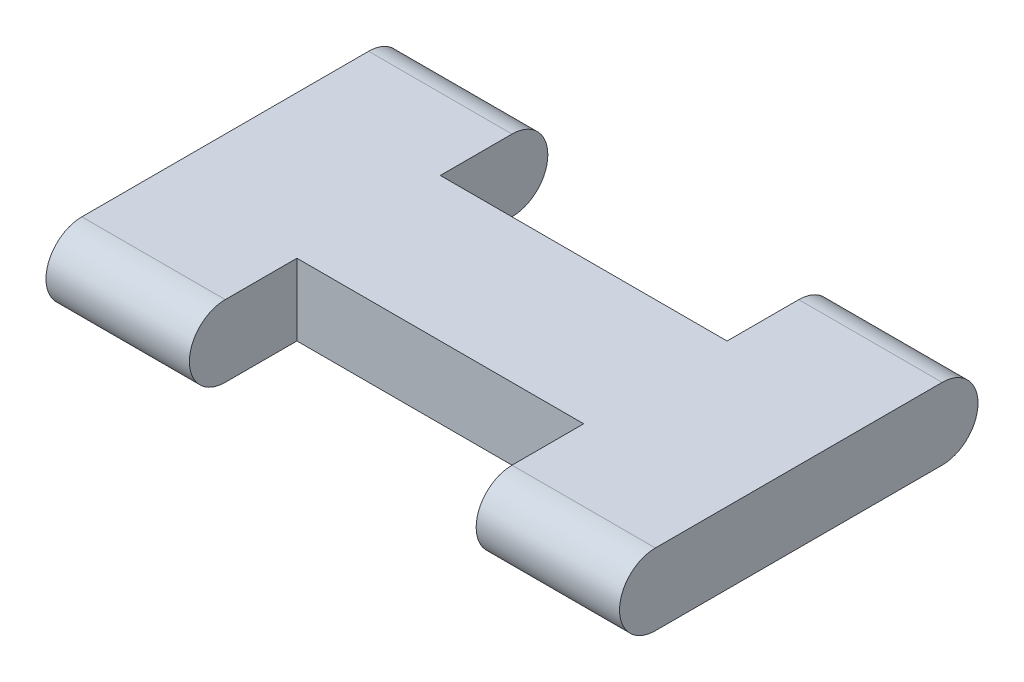
ISO-10303-21;
HEADER;
FILE_DESCRIPTION(('STEP AP214'),'2;1');
FILE_NAME('part.step','',(''),(''),'','','');
FILE_SCHEMA(('AUTOMOTIVE_DESIGN { 1 0 10303 214 1 1 1 1 }'));
ENDSEC;
DATA;
#1=APPLICATION_CONTEXT('core data for automotive mechanical design processes');
#2=APPLICATION_PROTOCOL_DEFINITION('international standard','automotive_design',2000,#1);
#3=PRODUCT_CONTEXT('',#1,'mechanical');
#4=PRODUCT('Part','Part','',(#3));
#5=PRODUCT_RELATED_PRODUCT_CATEGORY('part','',(#4));
#6=PRODUCT_DEFINITION_FORMATION('','',#4);
#7=PRODUCT_DEFINITION_CONTEXT('part definition',#1,'design');
#8=PRODUCT_DEFINITION('design','',#6,#7);
#9=PRODUCT_DEFINITION_SHAPE('','',#8);
#10=(LENGTH_UNIT() NAMED_UNIT(*) SI_UNIT(.MILLI.,.METRE.));
#11=(NAMED_UNIT(*) PLANE_ANGLE_UNIT() SI_UNIT($,.RADIAN.));
#12=(NAMED_UNIT(*) SI_UNIT($,.STERADIAN.) SOLID_ANGLE_UNIT());
#13=UNCERTAINTY_MEASURE_WITH_UNIT(LENGTH_MEASURE(1.E-05),#10,'distance_accuracy_value','');
#14=(GEOMETRIC_REPRESENTATION_CONTEXT(3) GLOBAL_UNCERTAINTY_ASSIGNED_CONTEXT((#13)) GLOBAL_UNIT_ASSIGNED_CONTEXT((#10,
#11,#12)) REPRESENTATION_CONTEXT('',''));
#15=CARTESIAN_POINT('',(0.,0.,0.));
#16=DIRECTION('',(0.,0.,1.));
#17=DIRECTION('',(1.,0.,0.));
#18=AXIS2_PLACEMENT_3D('',#15,#16,#17);
#19=CARTESIAN_POINT('',(16.,0.,4.));
#20=DIRECTION('',(-1.,0.,0.));
#21=DIRECTION('',(0.,0.,1.));
#22=AXIS2_PLACEMENT_3D('',#19,#20,#21);
#23=CYLINDRICAL_SURFACE('',#22,1.);
#24=DIRECTION('',(-1.,0.,0.));
#25=VECTOR('',#24,1.);
#26=CARTESIAN_POINT('',(16.,1.,4.));
#27=LINE('',#26,#25);
#28=CARTESIAN_POINT('',(16.,1.,4.));
#29=VERTEX_POINT('',#28);
#30=CARTESIAN_POINT('',(12.,1.,4.));
#31=VERTEX_POINT('',#30);
#32=EDGE_CURVE('E201',#29,#31,#27,.T.);
#33=ORIENTED_EDGE('',*,*,#32,.T.);
#34=CARTESIAN_POINT('',(12.,0.,4.));
#35=DIRECTION('',(1.,0.,0.));
#36=DIRECTION('',(0.,0.,-1.));
#37=AXIS2_PLACEMENT_3D('',#34,#35,#36);
#38=CIRCLE('',#37,1.);
#39=CARTESIAN_POINT('',(12.,-1.,4.));
#40=VERTEX_POINT('',#39);
#41=EDGE_CURVE('E165',#31,#40,#38,.T.);
#42=ORIENTED_EDGE('',*,*,#41,.T.);
#43=DIRECTION('',(-1.,0.,0.));
#44=VECTOR('',#43,1.);
#45=CARTESIAN_POINT('',(16.,-1.,4.));
#46=LINE('',#45,#44);
#47=CARTESIAN_POINT('',(16.,-1.,4.));
#48=VERTEX_POINT('',#47);
#49=EDGE_CURVE('E211',#48,#40,#46,.T.);
#50=ORIENTED_EDGE('',*,*,#49,.F.);
#51=CARTESIAN_POINT('',(16.,0.,4.));
#52=DIRECTION('',(1.,0.,0.));
#53=DIRECTION('',(0.,0.,-1.));
#54=AXIS2_PLACEMENT_3D('',#51,#52,#53);
#55=CIRCLE('',#54,1.);
#56=EDGE_CURVE('E180',#29,#48,#55,.T.);
#57=ORIENTED_EDGE('',*,*,#56,.F.);
#58=EDGE_LOOP('',(#33,#42,#50,#57));
#59=FACE_BOUND('',#58,.T.);
#60=ADVANCED_FACE('F34',(#59),#23,.T.);
#61=CARTESIAN_POINT('',(16.,0.,-4.));
#62=DIRECTION('',(-1.,0.,0.));
#63=DIRECTION('',(0.,0.,1.));
#64=AXIS2_PLACEMENT_3D('',#61,#62,#63);
#65=CYLINDRICAL_SURFACE('',#64,1.);
#66=DIRECTION('',(-1.,0.,0.));
#67=VECTOR('',#66,1.);
#68=CARTESIAN_POINT('',(16.,1.,-4.));
#69=LINE('',#68,#67);
#70=CARTESIAN_POINT('',(4.,1.,-4.));
#71=VERTEX_POINT('',#70);
#72=CARTESIAN_POINT('',(0.,1.,-4.));
#73=VERTEX_POINT('',#72);
#74=EDGE_CURVE('E204',#71,#73,#69,.T.);
#75=ORIENTED_EDGE('',*,*,#74,.F.);
#76=CARTESIAN_POINT('',(4.,0.,-4.));
#77=DIRECTION('',(-1.,0.,0.));
#78=DIRECTION('',(0.,0.,1.));
#79=AXIS2_PLACEMENT_3D('',#76,#77,#78);
#80=CIRCLE('',#79,1.);
#81=CARTESIAN_POINT('',(4.,-0.999999999999999,-4.));
#82=VERTEX_POINT('',#81);
#83=EDGE_CURVE('E173',#71,#82,#80,.T.);
#84=ORIENTED_EDGE('',*,*,#83,.T.);
#85=DIRECTION('',(-1.,0.,0.));
#86=VECTOR('',#85,1.);
#87=CARTESIAN_POINT('',(16.,-0.999999999999999,-4.));
#88=LINE('',#87,#86);
#89=CARTESIAN_POINT('',(0.,-0.999999999999999,-4.));
#90=VERTEX_POINT('',#89);
#91=EDGE_CURVE('E206',#82,#90,#88,.T.);
#92=ORIENTED_EDGE('',*,*,#91,.T.);
#93=CARTESIAN_POINT('',(0.,0.,-4.));
#94=DIRECTION('',(1.,0.,0.));
#95=DIRECTION('',(0.,0.,-1.));
#96=AXIS2_PLACEMENT_3D('',#93,#94,#95);
#97=CIRCLE('',#96,1.);
#98=EDGE_CURVE('E196',#90,#73,#97,.T.);
#99=ORIENTED_EDGE('',*,*,#98,.T.);
#100=EDGE_LOOP('',(#75,#84,#92,#99));
#101=FACE_BOUND('',#100,.T.);
#102=ADVANCED_FACE('F234',(#101),#65,.T.);
#103=CARTESIAN_POINT('',(4.,-1.,4.));
#104=VERTEX_POINT('',#103);
#105=CARTESIAN_POINT('',(0.,-1.,4.));
#106=VERTEX_POINT('',#105);
#107=EDGE_CURVE('E210',#104,#106,#46,.T.);
#108=ORIENTED_EDGE('',*,*,#107,.F.);
#109=CARTESIAN_POINT('',(4.,0.,4.));
#110=DIRECTION('',(-1.,0.,0.));
#111=DIRECTION('',(0.,0.,1.));
#112=AXIS2_PLACEMENT_3D('',#109,#110,#111);
#113=CIRCLE('',#112,1.);
#114=CARTESIAN_POINT('',(4.,1.,4.));
#115=VERTEX_POINT('',#114);
#116=EDGE_CURVE('E159',#104,#115,#113,.T.);
#117=ORIENTED_EDGE('',*,*,#116,.T.);
#118=CARTESIAN_POINT('',(0.,1.,4.));
#119=VERTEX_POINT('',#118);
#120=EDGE_CURVE('E190',#115,#119,#27,.T.);
#121=ORIENTED_EDGE('',*,*,#120,.T.);
#122=CARTESIAN_POINT('',(0.,0.,4.));
#123=DIRECTION('',(1.,0.,0.));
#124=DIRECTION('',(0.,0.,-1.));
#125=AXIS2_PLACEMENT_3D('',#122,#123,#124);
#126=CIRCLE('',#125,1.);
#127=EDGE_CURVE('E179',#119,#106,#126,.T.);
#128=ORIENTED_EDGE('',*,*,#127,.T.);
#129=EDGE_LOOP('',(#108,#117,#121,#128));
#130=FACE_BOUND('',#129,.T.);
#131=ADVANCED_FACE('F36',(#130),#23,.T.);
#132=CARTESIAN_POINT('',(16.,-1.,4.));
#133=DIRECTION('',(0.,1.,0.));
#134=DIRECTION('',(0.,0.,1.));
#135=AXIS2_PLACEMENT_3D('',#132,#133,#134);
#136=PLANE('',#135);
#137=ORIENTED_EDGE('',*,*,#91,.F.);
#138=DIRECTION('',(0.,0.,1.));
#139=VECTOR('',#138,1.);
#140=CARTESIAN_POINT('',(4.,-1.,4.));
#141=LINE('',#140,#139);
#142=CARTESIAN_POINT('',(4.,-0.999999999999999,-2.));
#143=VERTEX_POINT('',#142);
#144=EDGE_CURVE('E176',#82,#143,#141,.T.);
#145=ORIENTED_EDGE('',*,*,#144,.T.);
#146=DIRECTION('',(1.,0.,0.));
#147=VECTOR('',#146,1.);
#148=CARTESIAN_POINT('',(16.,-0.999999999999999,-2.));
#149=LINE('',#148,#147);
#150=CARTESIAN_POINT('',(12.,-0.999999999999999,-2.));
#151=VERTEX_POINT('',#150);
#152=EDGE_CURVE('E168',#143,#151,#149,.T.);
#153=ORIENTED_EDGE('',*,*,#152,.T.);
#154=DIRECTION('',(0.,0.,-1.));
#155=VECTOR('',#154,1.);
#156=CARTESIAN_POINT('',(12.,-1.,4.));
#157=LINE('',#156,#155);
#158=CARTESIAN_POINT('',(12.,-0.999999999999999,-4.));
#159=VERTEX_POINT('',#158);
#160=EDGE_CURVE('E130',#151,#159,#157,.T.);
#161=ORIENTED_EDGE('',*,*,#160,.T.);
#162=CARTESIAN_POINT('',(16.,-0.999999999999999,-4.));
#163=VERTEX_POINT('',#162);
#164=EDGE_CURVE('E207',#163,#159,#88,.T.);
#165=ORIENTED_EDGE('',*,*,#164,.F.);
#166=DIRECTION('',(0.,0.,-1.));
#167=VECTOR('',#166,1.);
#168=CARTESIAN_POINT('',(16.,-1.,4.));
#169=LINE('',#168,#167);
#170=EDGE_CURVE('E183',#48,#163,#169,.T.);
#171=ORIENTED_EDGE('',*,*,#170,.F.);
#172=ORIENTED_EDGE('',*,*,#49,.T.);
#173=DIRECTION('',(0.,0.,-1.));
#174=VECTOR('',#173,1.);
#175=CARTESIAN_POINT('',(12.,-1.,4.));
#176=LINE('',#175,#174);
#177=CARTESIAN_POINT('',(12.,-0.999999999999999,2.));
#178=VERTEX_POINT('',#177);
#179=EDGE_CURVE('E162',#40,#178,#176,.T.);
#180=ORIENTED_EDGE('',*,*,#179,.T.);
#181=DIRECTION('',(-1.,0.,0.));
#182=VECTOR('',#181,1.);
#183=CARTESIAN_POINT('',(16.,-1.,2.));
#184=LINE('',#183,#182);
#185=CARTESIAN_POINT('',(4.,-0.999999999999999,2.));
#186=VERTEX_POINT('',#185);
#187=EDGE_CURVE('E132',#178,#186,#184,.T.);
#188=ORIENTED_EDGE('',*,*,#187,.T.);
#189=DIRECTION('',(0.,0.,1.));
#190=VECTOR('',#189,1.);
#191=CARTESIAN_POINT('',(4.,-1.,4.));
#192=LINE('',#191,#190);
#193=EDGE_CURVE('E156',#186,#104,#192,.T.);
#194=ORIENTED_EDGE('',*,*,#193,.T.);
#195=ORIENTED_EDGE('',*,*,#107,.T.);
#196=DIRECTION('',(0.,0.,-1.));
#197=VECTOR('',#196,1.);
#198=CARTESIAN_POINT('',(0.,-1.,4.));
#199=LINE('',#198,#197);
#200=EDGE_CURVE('E193',#106,#90,#199,.T.);
#201=ORIENTED_EDGE('',*,*,#200,.T.);
#202=EDGE_LOOP('',(#137,#145,#153,#161,#165,#171,#172,#180,#188,#194,#195,#201));
#203=FACE_BOUND('',#202,.T.);
#204=ADVANCED_FACE('F229',(#203),#136,.F.);
#205=ORIENTED_EDGE('',*,*,#164,.T.);
#206=CARTESIAN_POINT('',(12.,0.,-4.));
#207=DIRECTION('',(1.,0.,0.));
#208=DIRECTION('',(0.,0.,-1.));
#209=AXIS2_PLACEMENT_3D('',#206,#207,#208);
#210=CIRCLE('',#209,1.);
#211=CARTESIAN_POINT('',(12.,1.,-4.));
#212=VERTEX_POINT('',#211);
#213=EDGE_CURVE('E170',#159,#212,#210,.T.);
#214=ORIENTED_EDGE('',*,*,#213,.T.);
#215=CARTESIAN_POINT('',(16.,1.,-4.));
#216=VERTEX_POINT('',#215);
#217=EDGE_CURVE('E144',#216,#212,#69,.T.);
#218=ORIENTED_EDGE('',*,*,#217,.F.);
#219=CARTESIAN_POINT('',(16.,0.,-4.));
#220=DIRECTION('',(1.,0.,0.));
#221=DIRECTION('',(0.,0.,-1.));
#222=AXIS2_PLACEMENT_3D('',#219,#220,#221);
#223=CIRCLE('',#222,1.);
#224=EDGE_CURVE('E186',#163,#216,#223,.T.);
#225=ORIENTED_EDGE('',*,*,#224,.F.);
#226=EDGE_LOOP('',(#205,#214,#218,#225));
#227=FACE_BOUND('',#226,.T.);
#228=ADVANCED_FACE('F226',(#227),#65,.T.);
#229=CARTESIAN_POINT('',(16.,1.,4.));
#230=DIRECTION('',(0.,-1.,0.));
#231=DIRECTION('',(0.,0.,-1.));
#232=AXIS2_PLACEMENT_3D('',#229,#230,#231);
#233=PLANE('',#232);
#234=DIRECTION('',(1.,0.,0.));
#235=VECTOR('',#234,1.);
#236=CARTESIAN_POINT('',(12.,1.,-2.));
#237=LINE('',#236,#235);
#238=CARTESIAN_POINT('',(4.,1.,-2.));
#239=VERTEX_POINT('',#238);
#240=CARTESIAN_POINT('',(12.,1.,-2.));
#241=VERTEX_POINT('',#240);
#242=EDGE_CURVE('E135',#239,#241,#237,.T.);
#243=ORIENTED_EDGE('',*,*,#242,.F.);
#244=DIRECTION('',(0.,0.,-1.));
#245=VECTOR('',#244,1.);
#246=CARTESIAN_POINT('',(4.,1.,4.));
#247=LINE('',#246,#245);
#248=EDGE_CURVE('E11',#239,#71,#247,.T.);
#249=ORIENTED_EDGE('',*,*,#248,.T.);
#250=ORIENTED_EDGE('',*,*,#74,.T.);
#251=DIRECTION('',(0.,0.,1.));
#252=VECTOR('',#251,1.);
#253=CARTESIAN_POINT('',(0.,1.,4.));
#254=LINE('',#253,#252);
#255=EDGE_CURVE('E184',#73,#119,#254,.T.);
#256=ORIENTED_EDGE('',*,*,#255,.T.);
#257=ORIENTED_EDGE('',*,*,#120,.F.);
#258=DIRECTION('',(0.,0.,1.));
#259=VECTOR('',#258,1.);
#260=CARTESIAN_POINT('',(4.,0.999999999999999,11.6503397412012));
#261=LINE('',#260,#259);
#262=CARTESIAN_POINT('',(4.,1.,2.));
#263=VERTEX_POINT('',#262);
#264=EDGE_CURVE('E150',#263,#115,#261,.T.);
#265=ORIENTED_EDGE('',*,*,#264,.F.);
#266=DIRECTION('',(-1.,0.,0.));
#267=VECTOR('',#266,1.);
#268=CARTESIAN_POINT('',(4.,1.,2.));
#269=LINE('',#268,#267);
#270=CARTESIAN_POINT('',(12.,1.,2.));
#271=VERTEX_POINT('',#270);
#272=EDGE_CURVE('E148',#271,#263,#269,.T.);
#273=ORIENTED_EDGE('',*,*,#272,.F.);
#274=DIRECTION('',(0.,0.,1.));
#275=VECTOR('',#274,1.);
#276=CARTESIAN_POINT('',(12.,1.,4.));
#277=LINE('',#276,#275);
#278=EDGE_CURVE('E42',#271,#31,#277,.T.);
#279=ORIENTED_EDGE('',*,*,#278,.T.);
#280=ORIENTED_EDGE('',*,*,#32,.F.);
#281=DIRECTION('',(0.,0.,1.));
#282=VECTOR('',#281,1.);
#283=CARTESIAN_POINT('',(16.,1.,4.));
#284=LINE('',#283,#282);
#285=EDGE_CURVE('E188',#216,#29,#284,.T.);
#286=ORIENTED_EDGE('',*,*,#285,.F.);
#287=ORIENTED_EDGE('',*,*,#217,.T.);
#288=DIRECTION('',(0.,0.,-1.));
#289=VECTOR('',#288,1.);
#290=CARTESIAN_POINT('',(12.,1.,-11.7088191648484));
#291=LINE('',#290,#289);
#292=EDGE_CURVE('E127',#241,#212,#291,.T.);
#293=ORIENTED_EDGE('',*,*,#292,.F.);
#294=EDGE_LOOP('',(#243,#249,#250,#256,#257,#265,#273,#279,#280,#286,#287,#293));
#295=FACE_BOUND('',#294,.T.);
#296=ADVANCED_FACE('F141',(#295),#233,.F.);
#297=CARTESIAN_POINT('',(16.,0.,4.));
#298=DIRECTION('',(1.,0.,0.));
#299=DIRECTION('',(0.,0.,-1.));
#300=AXIS2_PLACEMENT_3D('',#297,#298,#299);
#301=PLANE('',#300);
#302=ORIENTED_EDGE('',*,*,#56,.T.);
#303=ORIENTED_EDGE('',*,*,#170,.T.);
#304=ORIENTED_EDGE('',*,*,#224,.T.);
#305=ORIENTED_EDGE('',*,*,#285,.T.);
#306=EDGE_LOOP('',(#302,#303,#304,#305));
#307=FACE_BOUND('',#306,.T.);
#308=ADVANCED_FACE('F222',(#307),#301,.T.);
#309=CARTESIAN_POINT('',(0.,0.,4.));
#310=DIRECTION('',(1.,0.,0.));
#311=DIRECTION('',(0.,0.,-1.));
#312=AXIS2_PLACEMENT_3D('',#309,#310,#311);
#313=PLANE('',#312);
#314=ORIENTED_EDGE('',*,*,#127,.F.);
#315=ORIENTED_EDGE('',*,*,#255,.F.);
#316=ORIENTED_EDGE('',*,*,#98,.F.);
#317=ORIENTED_EDGE('',*,*,#200,.F.);
#318=EDGE_LOOP('',(#314,#315,#316,#317));
#319=FACE_BOUND('',#318,.T.);
#320=ADVANCED_FACE('F240',(#319),#313,.F.);
#321=CARTESIAN_POINT('',(12.,-13.,11.6503397412012));
#322=DIRECTION('',(1.,0.,0.));
#323=DIRECTION('',(0.,0.,-1.));
#324=AXIS2_PLACEMENT_3D('',#321,#322,#323);
#325=PLANE('',#324);
#326=ORIENTED_EDGE('',*,*,#278,.F.);
#327=DIRECTION('',(0.,1.,0.));
#328=VECTOR('',#327,1.);
#329=CARTESIAN_POINT('',(12.,-13.,2.));
#330=LINE('',#329,#328);
#331=EDGE_CURVE('E57',#178,#271,#330,.T.);
#332=ORIENTED_EDGE('',*,*,#331,.F.);
#333=ORIENTED_EDGE('',*,*,#179,.F.);
#334=ORIENTED_EDGE('',*,*,#41,.F.);
#335=EDGE_LOOP('',(#326,#332,#333,#334));
#336=FACE_BOUND('',#335,.T.);
#337=ADVANCED_FACE('F248',(#336),#325,.F.);
#338=CARTESIAN_POINT('',(4.,-13.,11.6503397412012));
#339=DIRECTION('',(-1.,0.,0.));
#340=DIRECTION('',(0.,0.,1.));
#341=AXIS2_PLACEMENT_3D('',#338,#339,#340);
#342=PLANE('',#341);
#343=ORIENTED_EDGE('',*,*,#193,.F.);
#344=DIRECTION('',(0.,1.,0.));
#345=VECTOR('',#344,1.);
#346=CARTESIAN_POINT('',(4.,-13.,2.));
#347=LINE('',#346,#345);
#348=EDGE_CURVE('E138',#186,#263,#347,.T.);
#349=ORIENTED_EDGE('',*,*,#348,.T.);
#350=ORIENTED_EDGE('',*,*,#264,.T.);
#351=ORIENTED_EDGE('',*,*,#116,.F.);
#352=EDGE_LOOP('',(#343,#349,#350,#351));
#353=FACE_BOUND('',#352,.T.);
#354=ADVANCED_FACE('F245',(#353),#342,.F.);
#355=CARTESIAN_POINT('',(4.,-13.,2.));
#356=DIRECTION('',(0.,0.,-1.));
#357=DIRECTION('',(0.,1.,0.));
#358=AXIS2_PLACEMENT_3D('',#355,#356,#357);
#359=PLANE('',#358);
#360=ORIENTED_EDGE('',*,*,#331,.T.);
#361=ORIENTED_EDGE('',*,*,#272,.T.);
#362=ORIENTED_EDGE('',*,*,#348,.F.);
#363=ORIENTED_EDGE('',*,*,#187,.F.);
#364=EDGE_LOOP('',(#360,#361,#362,#363));
#365=FACE_BOUND('',#364,.T.);
#366=ADVANCED_FACE('F247',(#365),#359,.F.);
#367=CARTESIAN_POINT('',(4.,-13.,-11.7088191648484));
#368=DIRECTION('',(-1.,0.,0.));
#369=DIRECTION('',(0.,0.,1.));
#370=AXIS2_PLACEMENT_3D('',#367,#368,#369);
#371=PLANE('',#370);
#372=ORIENTED_EDGE('',*,*,#83,.F.);
#373=ORIENTED_EDGE('',*,*,#248,.F.);
#374=DIRECTION('',(0.,1.,0.));
#375=VECTOR('',#374,1.);
#376=CARTESIAN_POINT('',(4.,-13.,-2.));
#377=LINE('',#376,#375);
#378=EDGE_CURVE('E49',#143,#239,#377,.T.);
#379=ORIENTED_EDGE('',*,*,#378,.F.);
#380=ORIENTED_EDGE('',*,*,#144,.F.);
#381=EDGE_LOOP('',(#372,#373,#379,#380));
#382=FACE_BOUND('',#381,.T.);
#383=ADVANCED_FACE('F231',(#382),#371,.F.);
#384=CARTESIAN_POINT('',(12.,-13.,-11.7088191648484));
#385=DIRECTION('',(1.,0.,0.));
#386=DIRECTION('',(0.,0.,-1.));
#387=AXIS2_PLACEMENT_3D('',#384,#385,#386);
#388=PLANE('',#387);
#389=DIRECTION('',(0.,1.,0.));
#390=VECTOR('',#389,1.);
#391=CARTESIAN_POINT('',(12.,-13.,-2.));
#392=LINE('',#391,#390);
#393=EDGE_CURVE('E124',#151,#241,#392,.T.);
#394=ORIENTED_EDGE('',*,*,#393,.T.);
#395=ORIENTED_EDGE('',*,*,#292,.T.);
#396=ORIENTED_EDGE('',*,*,#213,.F.);
#397=ORIENTED_EDGE('',*,*,#160,.F.);
#398=EDGE_LOOP('',(#394,#395,#396,#397));
#399=FACE_BOUND('',#398,.T.);
#400=ADVANCED_FACE('F125',(#399),#388,.F.);
#401=CARTESIAN_POINT('',(12.,-13.,-2.));
#402=DIRECTION('',(0.,0.,1.));
#403=DIRECTION('',(0.,-1.,0.));
#404=AXIS2_PLACEMENT_3D('',#401,#402,#403);
#405=PLANE('',#404);
#406=ORIENTED_EDGE('',*,*,#378,.T.);
#407=ORIENTED_EDGE('',*,*,#242,.T.);
#408=ORIENTED_EDGE('',*,*,#393,.F.);
#409=ORIENTED_EDGE('',*,*,#152,.F.);
#410=EDGE_LOOP('',(#406,#407,#408,#409));
#411=FACE_BOUND('',#410,.T.);
#412=ADVANCED_FACE('F136',(#411),#405,.F.);
#413=CLOSED_SHELL('',(#60,#102,#131,#204,#228,#296,#308,#320,#337,#354,#366,#383,#400,#412));
#414=MANIFOLD_SOLID_BREP('B2',#413);
#415=ADVANCED_BREP_SHAPE_REPRESENTATION('',(#18,#414),#14);
#416=SHAPE_DEFINITION_REPRESENTATION(#9,#415);
ENDSEC;
END-ISO-10303-21;
